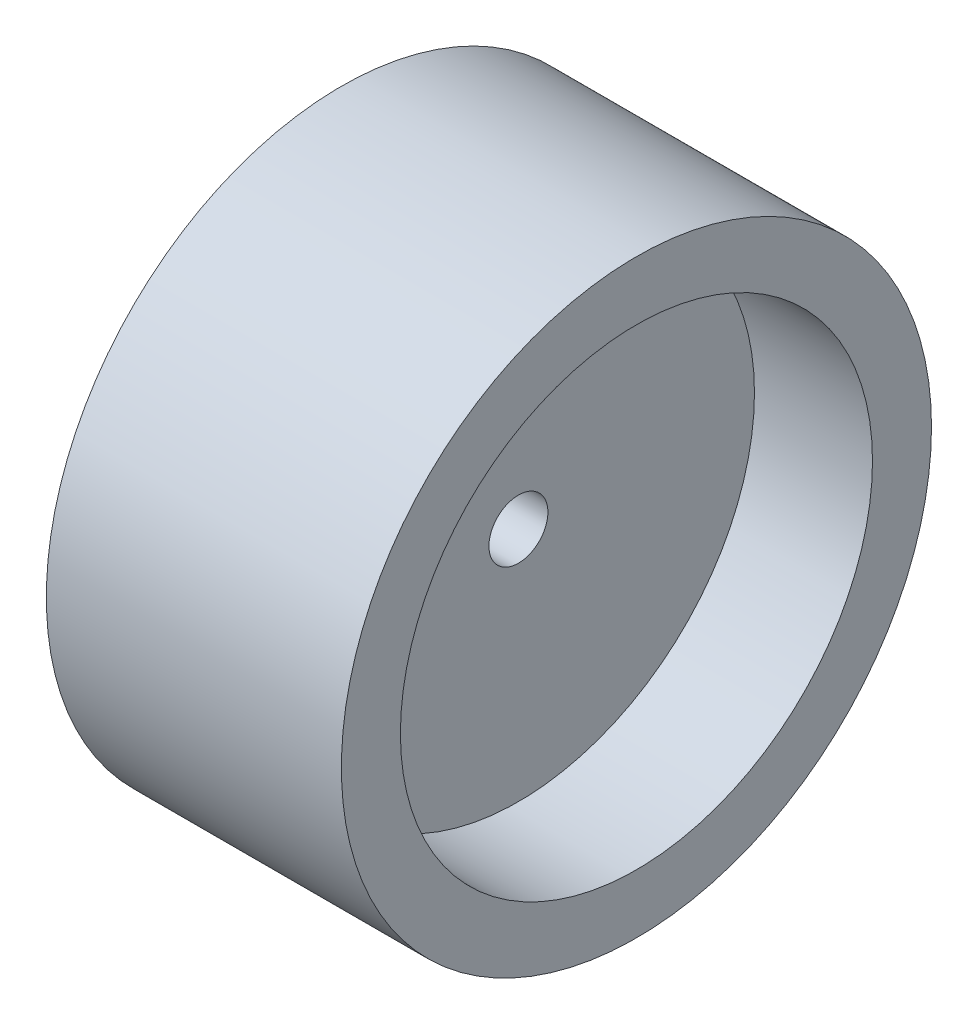
ISO-10303-21;
HEADER;
FILE_DESCRIPTION(('STEP AP214'),'2;1');
FILE_NAME('part.step','',(''),(''),'','','');
FILE_SCHEMA(('AUTOMOTIVE_DESIGN { 1 0 10303 214 1 1 1 1 }'));
ENDSEC;
DATA;
#1=APPLICATION_CONTEXT('core data for automotive mechanical design processes');
#2=APPLICATION_PROTOCOL_DEFINITION('international standard','automotive_design',2000,#1);
#3=PRODUCT_CONTEXT('',#1,'mechanical');
#4=PRODUCT('Part','Part','',(#3));
#5=PRODUCT_RELATED_PRODUCT_CATEGORY('part','',(#4));
#6=PRODUCT_DEFINITION_FORMATION('','',#4);
#7=PRODUCT_DEFINITION_CONTEXT('part definition',#1,'design');
#8=PRODUCT_DEFINITION('design','',#6,#7);
#9=PRODUCT_DEFINITION_SHAPE('','',#8);
#10=(LENGTH_UNIT() NAMED_UNIT(*) SI_UNIT(.MILLI.,.METRE.));
#11=(NAMED_UNIT(*) PLANE_ANGLE_UNIT() SI_UNIT($,.RADIAN.));
#12=(NAMED_UNIT(*) SI_UNIT($,.STERADIAN.) SOLID_ANGLE_UNIT());
#13=UNCERTAINTY_MEASURE_WITH_UNIT(LENGTH_MEASURE(1.E-05),#10,'distance_accuracy_value','');
#14=(GEOMETRIC_REPRESENTATION_CONTEXT(3) GLOBAL_UNCERTAINTY_ASSIGNED_CONTEXT((#13)) GLOBAL_UNIT_ASSIGNED_CONTEXT((#10,
#11,#12)) REPRESENTATION_CONTEXT('',''));
#15=CARTESIAN_POINT('',(0.,0.,0.));
#16=DIRECTION('',(0.,0.,1.));
#17=DIRECTION('',(1.,0.,0.));
#18=AXIS2_PLACEMENT_3D('',#15,#16,#17);
#19=CARTESIAN_POINT('',(25.,0.,0.));
#20=DIRECTION('',(-1.,0.,0.));
#21=DIRECTION('',(0.,0.,1.));
#22=AXIS2_PLACEMENT_3D('',#19,#20,#21);
#23=CYLINDRICAL_SURFACE('',#22,5.);
#24=CARTESIAN_POINT('',(-5.,0.,0.));
#25=DIRECTION('',(1.,0.,0.));
#26=DIRECTION('',(0.,0.,-1.));
#27=AXIS2_PLACEMENT_3D('',#24,#25,#26);
#28=CIRCLE('',#27,5.);
#29=CARTESIAN_POINT('',(-5.,0.,-5.));
#30=VERTEX_POINT('',#29);
#31=EDGE_CURVE('E58',#30,#30,#28,.T.);
#32=ORIENTED_EDGE('',*,*,#31,.F.);
#33=EDGE_LOOP('',(#32));
#34=FACE_BOUND('',#33,.T.);
#35=CARTESIAN_POINT('',(5.,0.,0.));
#36=DIRECTION('',(1.,0.,0.));
#37=DIRECTION('',(0.,0.,-1.));
#38=AXIS2_PLACEMENT_3D('',#35,#36,#37);
#39=CIRCLE('',#38,5.);
#40=CARTESIAN_POINT('',(5.,0.,-5.));
#41=VERTEX_POINT('',#40);
#42=EDGE_CURVE('E47',#41,#41,#39,.T.);
#43=ORIENTED_EDGE('',*,*,#42,.T.);
#44=EDGE_LOOP('',(#43));
#45=FACE_BOUND('',#44,.T.);
#46=ADVANCED_FACE('F43',(#34,#45),#23,.F.);
#47=CARTESIAN_POINT('',(25.,0.,0.));
#48=DIRECTION('',(1.,0.,0.));
#49=DIRECTION('',(0.,0.,-1.));
#50=AXIS2_PLACEMENT_3D('',#47,#48,#49);
#51=PLANE('',#50);
#52=CARTESIAN_POINT('',(25.,0.,0.));
#53=DIRECTION('',(1.,0.,0.));
#54=DIRECTION('',(0.,0.,-1.));
#55=AXIS2_PLACEMENT_3D('',#52,#53,#54);
#56=CIRCLE('',#55,40.);
#57=CARTESIAN_POINT('',(25.,0.,-40.));
#58=VERTEX_POINT('',#57);
#59=EDGE_CURVE('E79',#58,#58,#56,.T.);
#60=ORIENTED_EDGE('',*,*,#59,.F.);
#61=EDGE_LOOP('',(#60));
#62=FACE_BOUND('',#61,.T.);
#63=CARTESIAN_POINT('',(25.,0.,0.));
#64=DIRECTION('',(1.,0.,0.));
#65=DIRECTION('',(0.,0.,-1.));
#66=AXIS2_PLACEMENT_3D('',#63,#64,#65);
#67=CIRCLE('',#66,50.);
#68=CARTESIAN_POINT('',(25.,0.,-50.));
#69=VERTEX_POINT('',#68);
#70=EDGE_CURVE('E10',#69,#69,#67,.T.);
#71=ORIENTED_EDGE('',*,*,#70,.T.);
#72=EDGE_LOOP('',(#71));
#73=FACE_BOUND('',#72,.T.);
#74=ADVANCED_FACE('F105',(#62,#73),#51,.T.);
#75=CARTESIAN_POINT('',(-25.,0.,0.));
#76=DIRECTION('',(1.,0.,0.));
#77=DIRECTION('',(0.,0.,-1.));
#78=AXIS2_PLACEMENT_3D('',#75,#76,#77);
#79=PLANE('',#78);
#80=CARTESIAN_POINT('',(-25.,0.,0.));
#81=DIRECTION('',(1.,0.,0.));
#82=DIRECTION('',(0.,0.,-1.));
#83=AXIS2_PLACEMENT_3D('',#80,#81,#82);
#84=CIRCLE('',#83,40.);
#85=CARTESIAN_POINT('',(-25.,0.,-40.));
#86=VERTEX_POINT('',#85);
#87=EDGE_CURVE('E65',#86,#86,#84,.T.);
#88=ORIENTED_EDGE('',*,*,#87,.T.);
#89=EDGE_LOOP('',(#88));
#90=FACE_BOUND('',#89,.T.);
#91=CARTESIAN_POINT('',(-25.,0.,0.));
#92=DIRECTION('',(1.,0.,0.));
#93=DIRECTION('',(0.,0.,-1.));
#94=AXIS2_PLACEMENT_3D('',#91,#92,#93);
#95=CIRCLE('',#94,50.);
#96=CARTESIAN_POINT('',(-25.,0.,-50.));
#97=VERTEX_POINT('',#96);
#98=EDGE_CURVE('E52',#97,#97,#95,.T.);
#99=ORIENTED_EDGE('',*,*,#98,.F.);
#100=EDGE_LOOP('',(#99));
#101=FACE_BOUND('',#100,.T.);
#102=ADVANCED_FACE('F111',(#90,#101),#79,.F.);
#103=CARTESIAN_POINT('',(25.,0.,0.));
#104=DIRECTION('',(-1.,0.,0.));
#105=DIRECTION('',(0.,0.,1.));
#106=AXIS2_PLACEMENT_3D('',#103,#104,#105);
#107=CYLINDRICAL_SURFACE('',#106,50.);
#108=ORIENTED_EDGE('',*,*,#70,.F.);
#109=EDGE_LOOP('',(#108));
#110=FACE_BOUND('',#109,.T.);
#111=ORIENTED_EDGE('',*,*,#98,.T.);
#112=EDGE_LOOP('',(#111));
#113=FACE_BOUND('',#112,.T.);
#114=ADVANCED_FACE('F45',(#110,#113),#107,.T.);
#115=CARTESIAN_POINT('',(-25.,0.,0.));
#116=DIRECTION('',(1.,0.,0.));
#117=DIRECTION('',(0.,0.,-1.));
#118=AXIS2_PLACEMENT_3D('',#115,#116,#117);
#119=CYLINDRICAL_SURFACE('',#118,40.);
#120=ORIENTED_EDGE('',*,*,#87,.F.);
#121=EDGE_LOOP('',(#120));
#122=FACE_BOUND('',#121,.T.);
#123=CARTESIAN_POINT('',(-5.,0.,0.));
#124=DIRECTION('',(1.,0.,0.));
#125=DIRECTION('',(0.,0.,-1.));
#126=AXIS2_PLACEMENT_3D('',#123,#124,#125);
#127=CIRCLE('',#126,40.);
#128=CARTESIAN_POINT('',(-5.,0.,-40.));
#129=VERTEX_POINT('',#128);
#130=EDGE_CURVE('E61',#129,#129,#127,.T.);
#131=ORIENTED_EDGE('',*,*,#130,.T.);
#132=EDGE_LOOP('',(#131));
#133=FACE_BOUND('',#132,.T.);
#134=ADVANCED_FACE('F102',(#122,#133),#119,.F.);
#135=CARTESIAN_POINT('',(-5.,0.,0.));
#136=DIRECTION('',(1.,0.,0.));
#137=DIRECTION('',(0.,0.,-1.));
#138=AXIS2_PLACEMENT_3D('',#135,#136,#137);
#139=PLANE('',#138);
#140=ORIENTED_EDGE('',*,*,#31,.T.);
#141=EDGE_LOOP('',(#140));
#142=FACE_BOUND('',#141,.T.);
#143=ORIENTED_EDGE('',*,*,#130,.F.);
#144=EDGE_LOOP('',(#143));
#145=FACE_BOUND('',#144,.T.);
#146=ADVANCED_FACE('F97',(#142,#145),#139,.F.);
#147=CARTESIAN_POINT('',(25.,0.,0.));
#148=DIRECTION('',(-1.,0.,0.));
#149=DIRECTION('',(0.,0.,1.));
#150=AXIS2_PLACEMENT_3D('',#147,#148,#149);
#151=CYLINDRICAL_SURFACE('',#150,40.);
#152=ORIENTED_EDGE('',*,*,#59,.T.);
#153=EDGE_LOOP('',(#152));
#154=FACE_BOUND('',#153,.T.);
#155=CARTESIAN_POINT('',(5.,0.,0.));
#156=DIRECTION('',(1.,0.,0.));
#157=DIRECTION('',(0.,0.,-1.));
#158=AXIS2_PLACEMENT_3D('',#155,#156,#157);
#159=CIRCLE('',#158,40.);
#160=CARTESIAN_POINT('',(5.,0.,-40.));
#161=VERTEX_POINT('',#160);
#162=EDGE_CURVE('E75',#161,#161,#159,.T.);
#163=ORIENTED_EDGE('',*,*,#162,.F.);
#164=EDGE_LOOP('',(#163));
#165=FACE_BOUND('',#164,.T.);
#166=ADVANCED_FACE('F92',(#154,#165),#151,.F.);
#167=CARTESIAN_POINT('',(5.,0.,0.));
#168=DIRECTION('',(1.,0.,0.));
#169=DIRECTION('',(0.,0.,-1.));
#170=AXIS2_PLACEMENT_3D('',#167,#168,#169);
#171=PLANE('',#170);
#172=ORIENTED_EDGE('',*,*,#42,.F.);
#173=EDGE_LOOP('',(#172));
#174=FACE_BOUND('',#173,.T.);
#175=ORIENTED_EDGE('',*,*,#162,.T.);
#176=EDGE_LOOP('',(#175));
#177=FACE_BOUND('',#176,.T.);
#178=ADVANCED_FACE('F89',(#174,#177),#171,.T.);
#179=CLOSED_SHELL('',(#46,#74,#102,#114,#134,#146,#166,#178));
#180=MANIFOLD_SOLID_BREP('B2',#179);
#181=ADVANCED_BREP_SHAPE_REPRESENTATION('',(#18,#180),#14);
#182=SHAPE_DEFINITION_REPRESENTATION(#9,#181);
ENDSEC;
END-ISO-10303-21;
